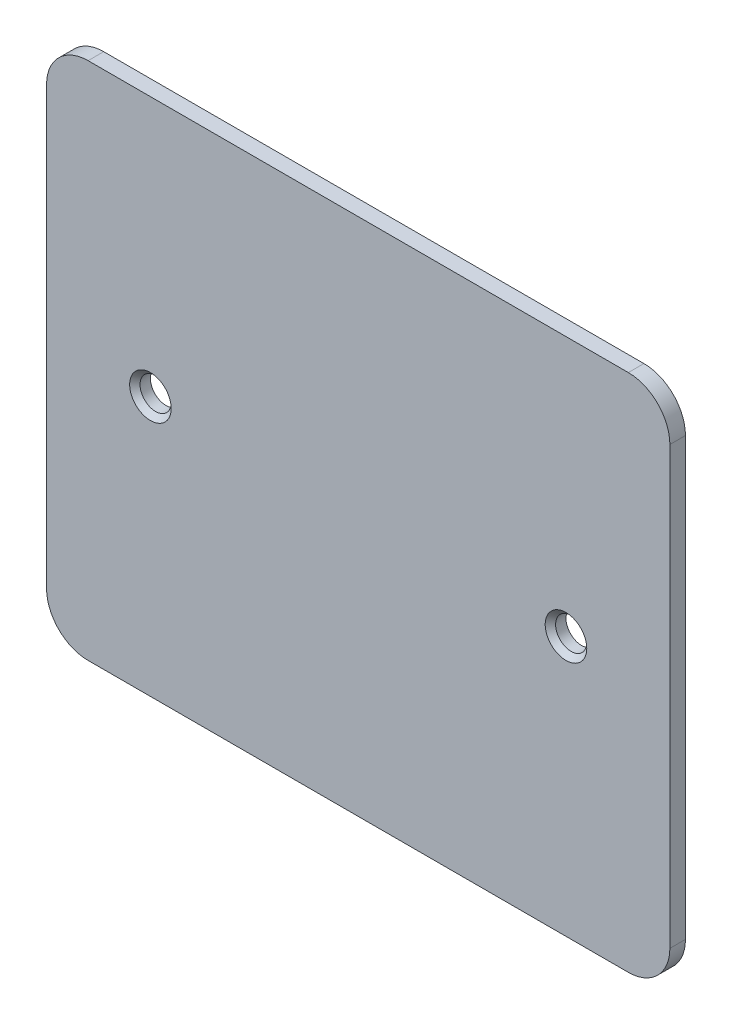
ISO-10303-21;
HEADER;
FILE_DESCRIPTION(('STEP AP214'),'2;1');
FILE_NAME('part.step','',(''),(''),'','','');
FILE_SCHEMA(('AUTOMOTIVE_DESIGN { 1 0 10303 214 1 1 1 1 }'));
ENDSEC;
DATA;
#1=APPLICATION_CONTEXT('core data for automotive mechanical design processes');
#2=APPLICATION_PROTOCOL_DEFINITION('international standard','automotive_design',2000,#1);
#3=PRODUCT_CONTEXT('',#1,'mechanical');
#4=PRODUCT('Part','Part','',(#3));
#5=PRODUCT_RELATED_PRODUCT_CATEGORY('part','',(#4));
#6=PRODUCT_DEFINITION_FORMATION('','',#4);
#7=PRODUCT_DEFINITION_CONTEXT('part definition',#1,'design');
#8=PRODUCT_DEFINITION('design','',#6,#7);
#9=PRODUCT_DEFINITION_SHAPE('','',#8);
#10=(LENGTH_UNIT() NAMED_UNIT(*) SI_UNIT(.MILLI.,.METRE.));
#11=(NAMED_UNIT(*) PLANE_ANGLE_UNIT() SI_UNIT($,.RADIAN.));
#12=(NAMED_UNIT(*) SI_UNIT($,.STERADIAN.) SOLID_ANGLE_UNIT());
#13=UNCERTAINTY_MEASURE_WITH_UNIT(LENGTH_MEASURE(1.E-05),#10,'distance_accuracy_value','');
#14=(GEOMETRIC_REPRESENTATION_CONTEXT(3) GLOBAL_UNCERTAINTY_ASSIGNED_CONTEXT((#13)) GLOBAL_UNIT_ASSIGNED_CONTEXT((#10,
#11,#12)) REPRESENTATION_CONTEXT('',''));
#15=CARTESIAN_POINT('',(0.,0.,0.));
#16=DIRECTION('',(0.,0.,1.));
#17=DIRECTION('',(1.,0.,0.));
#18=AXIS2_PLACEMENT_3D('',#15,#16,#17);
#19=CARTESIAN_POINT('',(0.,0.,1.5));
#20=DIRECTION('',(0.,0.,1.));
#21=DIRECTION('',(1.,0.,0.));
#22=AXIS2_PLACEMENT_3D('',#19,#20,#21);
#23=PLANE('',#22);
#24=CARTESIAN_POINT('',(-10.,25.,1.5));
#25=DIRECTION('',(0.,0.,1.));
#26=DIRECTION('',(1.,0.,0.));
#27=AXIS2_PLACEMENT_3D('',#24,#25,#26);
#28=CIRCLE('',#27,2.00000000000001);
#29=CARTESIAN_POINT('',(-7.99999999999999,25.,1.5));
#30=VERTEX_POINT('',#29);
#31=EDGE_CURVE('E140',#30,#30,#28,.F.);
#32=ORIENTED_EDGE('',*,*,#31,.T.);
#33=EDGE_LOOP('',(#32));
#34=FACE_BOUND('',#33,.T.);
#35=CARTESIAN_POINT('',(-50.,25.,1.5));
#36=DIRECTION('',(0.,0.,1.));
#37=DIRECTION('',(1.,0.,0.));
#38=AXIS2_PLACEMENT_3D('',#35,#36,#37);
#39=CIRCLE('',#38,2.00000000000001);
#40=CARTESIAN_POINT('',(-48.,25.,1.5));
#41=VERTEX_POINT('',#40);
#42=EDGE_CURVE('E137',#41,#41,#39,.F.);
#43=ORIENTED_EDGE('',*,*,#42,.T.);
#44=EDGE_LOOP('',(#43));
#45=FACE_BOUND('',#44,.T.);
#46=DIRECTION('',(0.,-1.,0.));
#47=VECTOR('',#46,1.);
#48=CARTESIAN_POINT('',(-60.,0.,1.5));
#49=LINE('',#48,#47);
#50=CARTESIAN_POINT('',(-60.,46.,1.5));
#51=VERTEX_POINT('',#50);
#52=CARTESIAN_POINT('',(-60.,3.99999999999999,1.5));
#53=VERTEX_POINT('',#52);
#54=EDGE_CURVE('E130',#51,#53,#49,.T.);
#55=ORIENTED_EDGE('',*,*,#54,.T.);
#56=CARTESIAN_POINT('',(-56.,3.99999999999999,1.5));
#57=DIRECTION('',(0.,0.,1.));
#58=DIRECTION('',(1.,0.,0.));
#59=AXIS2_PLACEMENT_3D('',#56,#57,#58);
#60=CIRCLE('',#59,4.);
#61=CARTESIAN_POINT('',(-56.,0.,1.5));
#62=VERTEX_POINT('',#61);
#63=EDGE_CURVE('E159',#53,#62,#60,.T.);
#64=ORIENTED_EDGE('',*,*,#63,.T.);
#65=DIRECTION('',(1.,0.,0.));
#66=VECTOR('',#65,1.);
#67=CARTESIAN_POINT('',(0.,0.,1.5));
#68=LINE('',#67,#66);
#69=CARTESIAN_POINT('',(-4.,0.,1.5));
#70=VERTEX_POINT('',#69);
#71=EDGE_CURVE('E113',#62,#70,#68,.T.);
#72=ORIENTED_EDGE('',*,*,#71,.T.);
#73=CARTESIAN_POINT('',(-4.,4.,1.5));
#74=DIRECTION('',(0.,0.,1.));
#75=DIRECTION('',(1.,0.,0.));
#76=AXIS2_PLACEMENT_3D('',#73,#74,#75);
#77=CIRCLE('',#76,4.);
#78=CARTESIAN_POINT('',(0.,4.,1.5));
#79=VERTEX_POINT('',#78);
#80=EDGE_CURVE('E157',#70,#79,#77,.T.);
#81=ORIENTED_EDGE('',*,*,#80,.T.);
#82=DIRECTION('',(0.,1.,0.));
#83=VECTOR('',#82,1.);
#84=CARTESIAN_POINT('',(0.,0.,1.5));
#85=LINE('',#84,#83);
#86=CARTESIAN_POINT('',(0.,46.,1.5));
#87=VERTEX_POINT('',#86);
#88=EDGE_CURVE('E120',#79,#87,#85,.T.);
#89=ORIENTED_EDGE('',*,*,#88,.T.);
#90=CARTESIAN_POINT('',(-4.,46.,1.5));
#91=DIRECTION('',(0.,0.,1.));
#92=DIRECTION('',(1.,0.,0.));
#93=AXIS2_PLACEMENT_3D('',#90,#91,#92);
#94=CIRCLE('',#93,4.);
#95=CARTESIAN_POINT('',(-4.,50.,1.5));
#96=VERTEX_POINT('',#95);
#97=EDGE_CURVE('E48',#87,#96,#94,.T.);
#98=ORIENTED_EDGE('',*,*,#97,.T.);
#99=DIRECTION('',(-1.,0.,0.));
#100=VECTOR('',#99,1.);
#101=CARTESIAN_POINT('',(0.,50.,1.5));
#102=LINE('',#101,#100);
#103=CARTESIAN_POINT('',(-56.,50.,1.5));
#104=VERTEX_POINT('',#103);
#105=EDGE_CURVE('E123',#96,#104,#102,.T.);
#106=ORIENTED_EDGE('',*,*,#105,.T.);
#107=CARTESIAN_POINT('',(-56.,46.,1.5));
#108=DIRECTION('',(0.,0.,1.));
#109=DIRECTION('',(1.,0.,0.));
#110=AXIS2_PLACEMENT_3D('',#107,#108,#109);
#111=CIRCLE('',#110,4.);
#112=EDGE_CURVE('E154',#104,#51,#111,.T.);
#113=ORIENTED_EDGE('',*,*,#112,.T.);
#114=EDGE_LOOP('',(#55,#64,#72,#81,#89,#98,#106,#113));
#115=FACE_BOUND('',#114,.T.);
#116=ADVANCED_FACE('F27',(#34,#45,#115),#23,.T.);
#117=CARTESIAN_POINT('',(0.,0.,0.));
#118=DIRECTION('',(0.,0.,1.));
#119=DIRECTION('',(1.,0.,0.));
#120=AXIS2_PLACEMENT_3D('',#117,#118,#119);
#121=PLANE('',#120);
#122=CARTESIAN_POINT('',(-50.,25.,0.));
#123=DIRECTION('',(0.,0.,1.));
#124=DIRECTION('',(1.,0.,0.));
#125=AXIS2_PLACEMENT_3D('',#122,#123,#124);
#126=CIRCLE('',#125,1.5);
#127=CARTESIAN_POINT('',(-48.5,25.,0.));
#128=VERTEX_POINT('',#127);
#129=EDGE_CURVE('E174',#128,#128,#126,.T.);
#130=ORIENTED_EDGE('',*,*,#129,.T.);
#131=EDGE_LOOP('',(#130));
#132=FACE_BOUND('',#131,.T.);
#133=DIRECTION('',(1.,0.,0.));
#134=VECTOR('',#133,1.);
#135=CARTESIAN_POINT('',(0.,0.,0.));
#136=LINE('',#135,#134);
#137=CARTESIAN_POINT('',(-56.,0.,0.));
#138=VERTEX_POINT('',#137);
#139=CARTESIAN_POINT('',(-4.,0.,0.));
#140=VERTEX_POINT('',#139);
#141=EDGE_CURVE('E110',#138,#140,#136,.T.);
#142=ORIENTED_EDGE('',*,*,#141,.F.);
#143=CARTESIAN_POINT('',(-56.,3.99999999999999,0.));
#144=DIRECTION('',(0.,0.,1.));
#145=DIRECTION('',(1.,0.,0.));
#146=AXIS2_PLACEMENT_3D('',#143,#144,#145);
#147=CIRCLE('',#146,4.);
#148=CARTESIAN_POINT('',(-60.,3.99999999999999,0.));
#149=VERTEX_POINT('',#148);
#150=EDGE_CURVE('E93',#138,#149,#147,.F.);
#151=ORIENTED_EDGE('',*,*,#150,.T.);
#152=DIRECTION('',(0.,-1.,0.));
#153=VECTOR('',#152,1.);
#154=CARTESIAN_POINT('',(-60.,0.,0.));
#155=LINE('',#154,#153);
#156=CARTESIAN_POINT('',(-60.,46.,0.));
#157=VERTEX_POINT('',#156);
#158=EDGE_CURVE('E121',#157,#149,#155,.T.);
#159=ORIENTED_EDGE('',*,*,#158,.F.);
#160=CARTESIAN_POINT('',(-56.,46.,0.));
#161=DIRECTION('',(0.,0.,1.));
#162=DIRECTION('',(1.,0.,0.));
#163=AXIS2_PLACEMENT_3D('',#160,#161,#162);
#164=CIRCLE('',#163,4.);
#165=CARTESIAN_POINT('',(-56.,50.,0.));
#166=VERTEX_POINT('',#165);
#167=EDGE_CURVE('E114',#157,#166,#164,.F.);
#168=ORIENTED_EDGE('',*,*,#167,.T.);
#169=DIRECTION('',(-1.,0.,0.));
#170=VECTOR('',#169,1.);
#171=CARTESIAN_POINT('',(0.,50.,0.));
#172=LINE('',#171,#170);
#173=CARTESIAN_POINT('',(-4.,50.,0.));
#174=VERTEX_POINT('',#173);
#175=EDGE_CURVE('E125',#174,#166,#172,.T.);
#176=ORIENTED_EDGE('',*,*,#175,.F.);
#177=CARTESIAN_POINT('',(-4.,46.,0.));
#178=DIRECTION('',(0.,0.,1.));
#179=DIRECTION('',(1.,0.,0.));
#180=AXIS2_PLACEMENT_3D('',#177,#178,#179);
#181=CIRCLE('',#180,4.);
#182=CARTESIAN_POINT('',(0.,46.,0.));
#183=VERTEX_POINT('',#182);
#184=EDGE_CURVE('E148',#174,#183,#181,.F.);
#185=ORIENTED_EDGE('',*,*,#184,.T.);
#186=DIRECTION('',(0.,1.,0.));
#187=VECTOR('',#186,1.);
#188=CARTESIAN_POINT('',(0.,0.,0.));
#189=LINE('',#188,#187);
#190=CARTESIAN_POINT('',(0.,4.,0.));
#191=VERTEX_POINT('',#190);
#192=EDGE_CURVE('E169',#191,#183,#189,.T.);
#193=ORIENTED_EDGE('',*,*,#192,.F.);
#194=CARTESIAN_POINT('',(-4.,4.,0.));
#195=DIRECTION('',(0.,0.,1.));
#196=DIRECTION('',(1.,0.,0.));
#197=AXIS2_PLACEMENT_3D('',#194,#195,#196);
#198=CIRCLE('',#197,4.);
#199=EDGE_CURVE('E104',#191,#140,#198,.F.);
#200=ORIENTED_EDGE('',*,*,#199,.T.);
#201=EDGE_LOOP('',(#142,#151,#159,#168,#176,#185,#193,#200));
#202=FACE_BOUND('',#201,.T.);
#203=CARTESIAN_POINT('',(-10.,25.,0.));
#204=DIRECTION('',(0.,0.,1.));
#205=DIRECTION('',(1.,0.,0.));
#206=AXIS2_PLACEMENT_3D('',#203,#204,#205);
#207=CIRCLE('',#206,1.5);
#208=CARTESIAN_POINT('',(-8.5,25.,0.));
#209=VERTEX_POINT('',#208);
#210=EDGE_CURVE('E177',#209,#209,#207,.T.);
#211=ORIENTED_EDGE('',*,*,#210,.T.);
#212=EDGE_LOOP('',(#211));
#213=FACE_BOUND('',#212,.T.);
#214=ADVANCED_FACE('F117',(#132,#202,#213),#121,.F.);
#215=CARTESIAN_POINT('',(0.,0.,1.5));
#216=DIRECTION('',(-1.,0.,0.));
#217=DIRECTION('',(0.,-1.,0.));
#218=AXIS2_PLACEMENT_3D('',#215,#216,#217);
#219=PLANE('',#218);
#220=ORIENTED_EDGE('',*,*,#88,.F.);
#221=DIRECTION('',(0.,0.,-1.));
#222=VECTOR('',#221,1.);
#223=CARTESIAN_POINT('',(0.,4.,1.5));
#224=LINE('',#223,#222);
#225=EDGE_CURVE('E163',#79,#191,#224,.T.);
#226=ORIENTED_EDGE('',*,*,#225,.T.);
#227=ORIENTED_EDGE('',*,*,#192,.T.);
#228=DIRECTION('',(0.,0.,-1.));
#229=VECTOR('',#228,1.);
#230=CARTESIAN_POINT('',(0.,46.,1.5));
#231=LINE('',#230,#229);
#232=EDGE_CURVE('E161',#183,#87,#231,.F.);
#233=ORIENTED_EDGE('',*,*,#232,.T.);
#234=EDGE_LOOP('',(#220,#226,#227,#233));
#235=FACE_BOUND('',#234,.T.);
#236=ADVANCED_FACE('F29',(#235),#219,.F.);
#237=CARTESIAN_POINT('',(0.,50.,1.5));
#238=DIRECTION('',(0.,-1.,0.));
#239=DIRECTION('',(1.,0.,0.));
#240=AXIS2_PLACEMENT_3D('',#237,#238,#239);
#241=PLANE('',#240);
#242=ORIENTED_EDGE('',*,*,#105,.F.);
#243=DIRECTION('',(0.,0.,-1.));
#244=VECTOR('',#243,1.);
#245=CARTESIAN_POINT('',(-4.,50.,1.5));
#246=LINE('',#245,#244);
#247=EDGE_CURVE('E11',#96,#174,#246,.T.);
#248=ORIENTED_EDGE('',*,*,#247,.T.);
#249=ORIENTED_EDGE('',*,*,#175,.T.);
#250=DIRECTION('',(0.,0.,-1.));
#251=VECTOR('',#250,1.);
#252=CARTESIAN_POINT('',(-56.,50.,1.5));
#253=LINE('',#252,#251);
#254=EDGE_CURVE('E35',#166,#104,#253,.F.);
#255=ORIENTED_EDGE('',*,*,#254,.T.);
#256=EDGE_LOOP('',(#242,#248,#249,#255));
#257=FACE_BOUND('',#256,.T.);
#258=ADVANCED_FACE('F213',(#257),#241,.F.);
#259=CARTESIAN_POINT('',(-60.,0.,1.5));
#260=DIRECTION('',(1.,0.,0.));
#261=DIRECTION('',(0.,0.,-1.));
#262=AXIS2_PLACEMENT_3D('',#259,#260,#261);
#263=PLANE('',#262);
#264=ORIENTED_EDGE('',*,*,#158,.T.);
#265=DIRECTION('',(0.,0.,-1.));
#266=VECTOR('',#265,1.);
#267=CARTESIAN_POINT('',(-60.,3.99999999999999,1.5));
#268=LINE('',#267,#266);
#269=EDGE_CURVE('E98',#149,#53,#268,.F.);
#270=ORIENTED_EDGE('',*,*,#269,.T.);
#271=ORIENTED_EDGE('',*,*,#54,.F.);
#272=DIRECTION('',(0.,0.,-1.));
#273=VECTOR('',#272,1.);
#274=CARTESIAN_POINT('',(-60.,46.,1.5));
#275=LINE('',#274,#273);
#276=EDGE_CURVE('E103',#51,#157,#275,.T.);
#277=ORIENTED_EDGE('',*,*,#276,.T.);
#278=EDGE_LOOP('',(#264,#270,#271,#277));
#279=FACE_BOUND('',#278,.T.);
#280=ADVANCED_FACE('F211',(#279),#263,.F.);
#281=CARTESIAN_POINT('',(0.,0.,1.5));
#282=DIRECTION('',(0.,1.,0.));
#283=DIRECTION('',(-1.,0.,0.));
#284=AXIS2_PLACEMENT_3D('',#281,#282,#283);
#285=PLANE('',#284);
#286=ORIENTED_EDGE('',*,*,#71,.F.);
#287=DIRECTION('',(0.,0.,-1.));
#288=VECTOR('',#287,1.);
#289=CARTESIAN_POINT('',(-56.,0.,1.5));
#290=LINE('',#289,#288);
#291=EDGE_CURVE('E97',#62,#138,#290,.T.);
#292=ORIENTED_EDGE('',*,*,#291,.T.);
#293=ORIENTED_EDGE('',*,*,#141,.T.);
#294=DIRECTION('',(0.,0.,-1.));
#295=VECTOR('',#294,1.);
#296=CARTESIAN_POINT('',(-4.,0.,1.5));
#297=LINE('',#296,#295);
#298=EDGE_CURVE('E115',#140,#70,#297,.F.);
#299=ORIENTED_EDGE('',*,*,#298,.T.);
#300=EDGE_LOOP('',(#286,#292,#293,#299));
#301=FACE_BOUND('',#300,.T.);
#302=ADVANCED_FACE('F109',(#301),#285,.F.);
#303=CARTESIAN_POINT('',(-50.,25.,1.5));
#304=DIRECTION('',(0.,0.,-1.));
#305=DIRECTION('',(-1.,0.,0.));
#306=AXIS2_PLACEMENT_3D('',#303,#304,#305);
#307=CYLINDRICAL_SURFACE('',#306,1.5);
#308=CARTESIAN_POINT('',(-50.,25.,1.));
#309=DIRECTION('',(0.,0.,1.));
#310=DIRECTION('',(1.,0.,0.));
#311=AXIS2_PLACEMENT_3D('',#308,#309,#310);
#312=CIRCLE('',#311,1.5);
#313=CARTESIAN_POINT('',(-48.5,25.,1.));
#314=VERTEX_POINT('',#313);
#315=EDGE_CURVE('E143',#314,#314,#312,.T.);
#316=ORIENTED_EDGE('',*,*,#315,.T.);
#317=EDGE_LOOP('',(#316));
#318=FACE_BOUND('',#317,.T.);
#319=ORIENTED_EDGE('',*,*,#129,.F.);
#320=EDGE_LOOP('',(#319));
#321=FACE_BOUND('',#320,.T.);
#322=ADVANCED_FACE('F186',(#318,#321),#307,.F.);
#323=CARTESIAN_POINT('',(-10.,25.,1.5));
#324=DIRECTION('',(0.,0.,-1.));
#325=DIRECTION('',(-1.,0.,0.));
#326=AXIS2_PLACEMENT_3D('',#323,#324,#325);
#327=CYLINDRICAL_SURFACE('',#326,1.5);
#328=CARTESIAN_POINT('',(-10.,25.,1.));
#329=DIRECTION('',(0.,0.,1.));
#330=DIRECTION('',(1.,0.,0.));
#331=AXIS2_PLACEMENT_3D('',#328,#329,#330);
#332=CIRCLE('',#331,1.5);
#333=CARTESIAN_POINT('',(-8.5,25.,1.));
#334=VERTEX_POINT('',#333);
#335=EDGE_CURVE('E134',#334,#334,#332,.T.);
#336=ORIENTED_EDGE('',*,*,#335,.T.);
#337=EDGE_LOOP('',(#336));
#338=FACE_BOUND('',#337,.T.);
#339=ORIENTED_EDGE('',*,*,#210,.F.);
#340=EDGE_LOOP('',(#339));
#341=FACE_BOUND('',#340,.T.);
#342=ADVANCED_FACE('F183',(#338,#341),#327,.F.);
#343=CARTESIAN_POINT('',(-10.,25.,1.));
#344=DIRECTION('',(0.,0.,1.));
#345=DIRECTION('',(1.,0.,0.));
#346=AXIS2_PLACEMENT_3D('',#343,#344,#345);
#347=CONICAL_SURFACE('',#346,1.5,0.785398163397457);
#348=ORIENTED_EDGE('',*,*,#31,.F.);
#349=EDGE_LOOP('',(#348));
#350=FACE_BOUND('',#349,.T.);
#351=ORIENTED_EDGE('',*,*,#335,.F.);
#352=EDGE_LOOP('',(#351));
#353=FACE_BOUND('',#352,.T.);
#354=ADVANCED_FACE('F185',(#350,#353),#347,.F.);
#355=CARTESIAN_POINT('',(-50.,25.,1.));
#356=DIRECTION('',(0.,0.,1.));
#357=DIRECTION('',(1.,0.,0.));
#358=AXIS2_PLACEMENT_3D('',#355,#356,#357);
#359=CONICAL_SURFACE('',#358,1.5,0.785398163397457);
#360=ORIENTED_EDGE('',*,*,#42,.F.);
#361=EDGE_LOOP('',(#360));
#362=FACE_BOUND('',#361,.T.);
#363=ORIENTED_EDGE('',*,*,#315,.F.);
#364=EDGE_LOOP('',(#363));
#365=FACE_BOUND('',#364,.T.);
#366=ADVANCED_FACE('F193',(#362,#365),#359,.F.);
#367=CARTESIAN_POINT('',(-56.,3.99999999999999,1.5));
#368=DIRECTION('',(0.,0.,-1.));
#369=DIRECTION('',(-1.,0.,0.));
#370=AXIS2_PLACEMENT_3D('',#367,#368,#369);
#371=CYLINDRICAL_SURFACE('',#370,4.);
#372=ORIENTED_EDGE('',*,*,#63,.F.);
#373=ORIENTED_EDGE('',*,*,#269,.F.);
#374=ORIENTED_EDGE('',*,*,#150,.F.);
#375=ORIENTED_EDGE('',*,*,#291,.F.);
#376=EDGE_LOOP('',(#372,#373,#374,#375));
#377=FACE_BOUND('',#376,.T.);
#378=ADVANCED_FACE('F96',(#377),#371,.T.);
#379=CARTESIAN_POINT('',(-4.,4.,1.5));
#380=DIRECTION('',(0.,0.,-1.));
#381=DIRECTION('',(-1.,0.,0.));
#382=AXIS2_PLACEMENT_3D('',#379,#380,#381);
#383=CYLINDRICAL_SURFACE('',#382,4.);
#384=ORIENTED_EDGE('',*,*,#80,.F.);
#385=ORIENTED_EDGE('',*,*,#298,.F.);
#386=ORIENTED_EDGE('',*,*,#199,.F.);
#387=ORIENTED_EDGE('',*,*,#225,.F.);
#388=EDGE_LOOP('',(#384,#385,#386,#387));
#389=FACE_BOUND('',#388,.T.);
#390=ADVANCED_FACE('F223',(#389),#383,.T.);
#391=CARTESIAN_POINT('',(-4.,46.,1.5));
#392=DIRECTION('',(0.,0.,-1.));
#393=DIRECTION('',(-1.,0.,0.));
#394=AXIS2_PLACEMENT_3D('',#391,#392,#393);
#395=CYLINDRICAL_SURFACE('',#394,4.);
#396=ORIENTED_EDGE('',*,*,#97,.F.);
#397=ORIENTED_EDGE('',*,*,#232,.F.);
#398=ORIENTED_EDGE('',*,*,#184,.F.);
#399=ORIENTED_EDGE('',*,*,#247,.F.);
#400=EDGE_LOOP('',(#396,#397,#398,#399));
#401=FACE_BOUND('',#400,.T.);
#402=ADVANCED_FACE('F222',(#401),#395,.T.);
#403=CARTESIAN_POINT('',(-56.,46.,1.5));
#404=DIRECTION('',(0.,0.,-1.));
#405=DIRECTION('',(-1.,0.,0.));
#406=AXIS2_PLACEMENT_3D('',#403,#404,#405);
#407=CYLINDRICAL_SURFACE('',#406,4.);
#408=ORIENTED_EDGE('',*,*,#112,.F.);
#409=ORIENTED_EDGE('',*,*,#254,.F.);
#410=ORIENTED_EDGE('',*,*,#167,.F.);
#411=ORIENTED_EDGE('',*,*,#276,.F.);
#412=EDGE_LOOP('',(#408,#409,#410,#411));
#413=FACE_BOUND('',#412,.T.);
#414=ADVANCED_FACE('F230',(#413),#407,.T.);
#415=CLOSED_SHELL('',(#116,#214,#236,#258,#280,#302,#322,#342,#354,#366,#378,#390,#402,#414));
#416=MANIFOLD_SOLID_BREP('B2',#415);
#417=ADVANCED_BREP_SHAPE_REPRESENTATION('',(#18,#416),#14);
#418=SHAPE_DEFINITION_REPRESENTATION(#9,#417);
ENDSEC;
END-ISO-10303-21;
